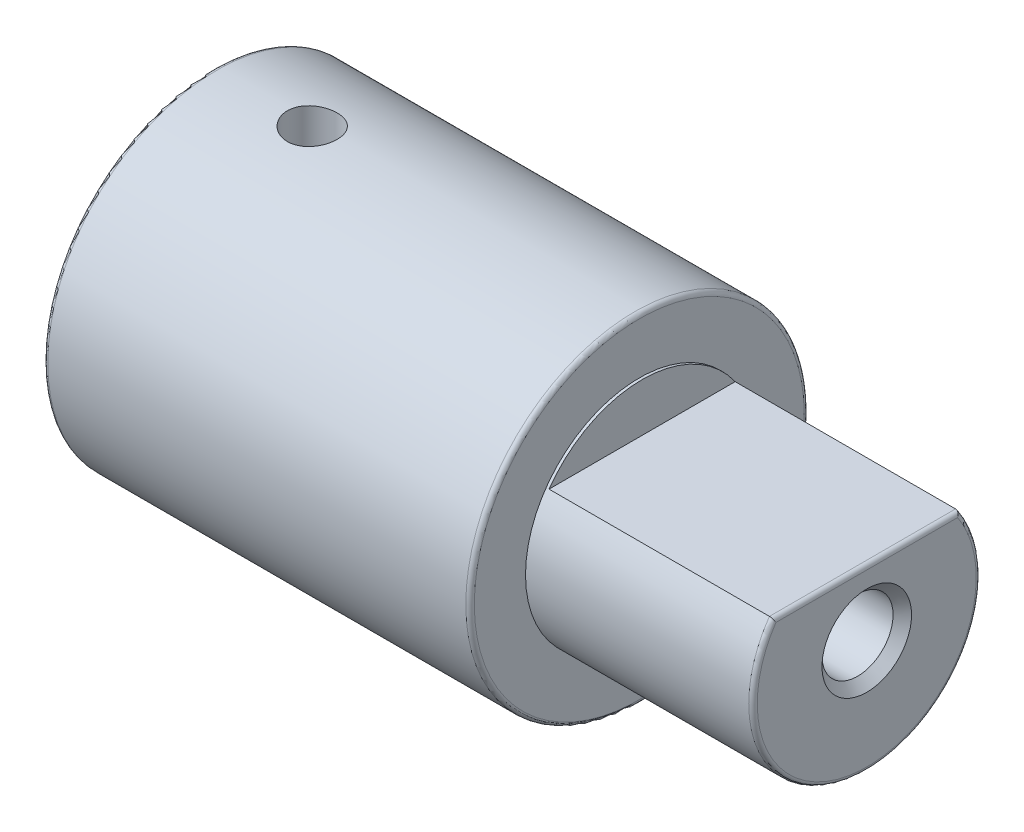
ISO-10303-21;
HEADER;
FILE_DESCRIPTION(('STEP AP214'),'2;1');
FILE_NAME('part.step','',(''),(''),'','','');
FILE_SCHEMA(('AUTOMOTIVE_DESIGN { 1 0 10303 214 1 1 1 1 }'));
ENDSEC;
DATA;
#1=APPLICATION_CONTEXT('core data for automotive mechanical design processes');
#2=APPLICATION_PROTOCOL_DEFINITION('international standard','automotive_design',2000,#1);
#3=PRODUCT_CONTEXT('',#1,'mechanical');
#4=PRODUCT('Part','Part','',(#3));
#5=PRODUCT_RELATED_PRODUCT_CATEGORY('part','',(#4));
#6=PRODUCT_DEFINITION_FORMATION('','',#4);
#7=PRODUCT_DEFINITION_CONTEXT('part definition',#1,'design');
#8=PRODUCT_DEFINITION('design','',#6,#7);
#9=PRODUCT_DEFINITION_SHAPE('','',#8);
#10=(LENGTH_UNIT() NAMED_UNIT(*) SI_UNIT(.MILLI.,.METRE.));
#11=(NAMED_UNIT(*) PLANE_ANGLE_UNIT() SI_UNIT($,.RADIAN.));
#12=(NAMED_UNIT(*) SI_UNIT($,.STERADIAN.) SOLID_ANGLE_UNIT());
#13=UNCERTAINTY_MEASURE_WITH_UNIT(LENGTH_MEASURE(1.E-05),#10,'distance_accuracy_value','');
#14=(GEOMETRIC_REPRESENTATION_CONTEXT(3) GLOBAL_UNCERTAINTY_ASSIGNED_CONTEXT((#13)) GLOBAL_UNIT_ASSIGNED_CONTEXT((#10,
#11,#12)) REPRESENTATION_CONTEXT('',''));
#15=CARTESIAN_POINT('',(0.,0.,0.));
#16=DIRECTION('',(0.,0.,1.));
#17=DIRECTION('',(1.,0.,0.));
#18=AXIS2_PLACEMENT_3D('',#15,#16,#17);
#19=CARTESIAN_POINT('',(22.9999999999677,0.,0.));
#20=DIRECTION('',(1.,0.,0.));
#21=DIRECTION('',(0.,0.,-1.));
#22=AXIS2_PLACEMENT_3D('',#19,#20,#21);
#23=CONICAL_SURFACE('',#22,1.5749999999457,0.785398163397448);
#24=CARTESIAN_POINT('',(22.675,0.,0.));
#25=DIRECTION('',(1.,0.,0.));
#26=DIRECTION('',(0.,0.,-1.));
#27=AXIS2_PLACEMENT_3D('',#24,#25,#26);
#28=CIRCLE('',#27,1.25);
#29=CARTESIAN_POINT('',(22.675,0.,-1.25));
#30=VERTEX_POINT('',#29);
#31=EDGE_CURVE('E311',#30,#30,#28,.F.);
#32=ORIENTED_EDGE('',*,*,#31,.T.);
#33=EDGE_LOOP('',(#32));
#34=FACE_BOUND('',#33,.T.);
#35=CARTESIAN_POINT('',(23.0000000000246,0.,0.));
#36=DIRECTION('',(1.,0.,0.));
#37=DIRECTION('',(0.,0.,-1.));
#38=AXIS2_PLACEMENT_3D('',#35,#36,#37);
#39=CIRCLE('',#38,1.57500000000255);
#40=CARTESIAN_POINT('',(23.0000000000246,0.,-1.57500000000255));
#41=VERTEX_POINT('',#40);
#42=EDGE_CURVE('E105',#41,#41,#39,.T.);
#43=ORIENTED_EDGE('',*,*,#42,.T.);
#44=EDGE_LOOP('',(#43));
#45=FACE_BOUND('',#44,.T.);
#46=ADVANCED_FACE('F17',(#34,#45),#23,.F.);
#47=CARTESIAN_POINT('',(23.,0.,0.));
#48=DIRECTION('',(-1.,0.,0.));
#49=DIRECTION('',(0.,0.,1.));
#50=AXIS2_PLACEMENT_3D('',#47,#48,#49);
#51=PLANE('',#50);
#52=ORIENTED_EDGE('',*,*,#42,.F.);
#53=EDGE_LOOP('',(#52));
#54=FACE_BOUND('',#53,.T.);
#55=CARTESIAN_POINT('',(23.,0.,0.));
#56=DIRECTION('',(-1.,0.,0.));
#57=DIRECTION('',(0.,0.,-1.));
#58=AXIS2_PLACEMENT_3D('',#55,#56,#57);
#59=CIRCLE('',#58,3.85);
#60=CARTESIAN_POINT('',(23.,0.,-3.85));
#61=VERTEX_POINT('',#60);
#62=CARTESIAN_POINT('',(23.,0.,3.85));
#63=VERTEX_POINT('',#62);
#64=EDGE_CURVE('E303',#61,#63,#59,.T.);
#65=ORIENTED_EDGE('',*,*,#64,.F.);
#66=CARTESIAN_POINT('',(23.,0.,0.));
#67=DIRECTION('',(-1.,0.,0.));
#68=DIRECTION('',(0.,0.558441558441559,-0.829543866112795));
#69=AXIS2_PLACEMENT_3D('',#66,#67,#68);
#70=CIRCLE('',#69,3.85);
#71=CARTESIAN_POINT('',(23.,2.15,-3.19374388453426));
#72=VERTEX_POINT('',#71);
#73=EDGE_CURVE('E301',#72,#61,#70,.T.);
#74=ORIENTED_EDGE('',*,*,#73,.F.);
#75=DIRECTION('',(0.,0.,-1.));
#76=VECTOR('',#75,1.);
#77=CARTESIAN_POINT('',(23.,2.15,3.27261363439071));
#78=LINE('',#77,#76);
#79=CARTESIAN_POINT('',(23.,2.15,3.19374388453426));
#80=VERTEX_POINT('',#79);
#81=EDGE_CURVE('E108',#80,#72,#78,.T.);
#82=ORIENTED_EDGE('',*,*,#81,.F.);
#83=CARTESIAN_POINT('',(23.,0.,0.));
#84=DIRECTION('',(-1.,0.,0.));
#85=DIRECTION('',(0.,0.,1.));
#86=AXIS2_PLACEMENT_3D('',#83,#84,#85);
#87=CIRCLE('',#86,3.85);
#88=EDGE_CURVE('E310',#63,#80,#87,.T.);
#89=ORIENTED_EDGE('',*,*,#88,.F.);
#90=EDGE_LOOP('',(#65,#74,#82,#89));
#91=FACE_BOUND('',#90,.T.);
#92=ADVANCED_FACE('F388',(#54,#91),#51,.F.);
#93=CARTESIAN_POINT('',(22.85,2.15,3.27261363439071));
#94=DIRECTION('',(0.,0.,-1.));
#95=DIRECTION('',(-1.,0.,0.));
#96=AXIS2_PLACEMENT_3D('',#93,#94,#95);
#97=CYLINDRICAL_SURFACE('',#96,0.150000000000001);
#98=CARTESIAN_POINT('',(22.85,2.3,-3.27261363439071));
#99=CARTESIAN_POINT('',(22.8524318392568,2.30000008341764,-3.27261370406818));
#100=CARTESIAN_POINT('',(22.8548636229384,2.29993940416577,-3.27258394411226));
#101=CARTESIAN_POINT('',(22.8597373837745,2.29969730815042,-3.27246409428101));
#102=CARTESIAN_POINT('',(22.8621793069761,2.29951501906196,-3.27237356849433));
#103=CARTESIAN_POINT('',(22.8670673497827,2.29902862361025,-3.27213055168672));
#104=CARTESIAN_POINT('',(22.8695133508707,2.29872356880205,-3.27197757808033));
#105=CARTESIAN_POINT('',(22.8744034044036,2.29799087466964,-3.27160834583458));
#106=CARTESIAN_POINT('',(22.8768472646861,2.29756221845494,-3.27139156189498));
#107=CARTESIAN_POINT('',(22.8817266989836,2.29658171891855,-3.27089358607451));
#108=CARTESIAN_POINT('',(22.8841619985871,2.29602879748348,-3.2706118299068));
#109=CARTESIAN_POINT('',(22.8890178101046,2.29479938177936,-3.26998303249975));
#110=CARTESIAN_POINT('',(22.8914379579059,2.2941217563713,-3.26963539271823));
#111=CARTESIAN_POINT('',(22.8962568111002,2.29264276144623,-3.26887420008181));
#112=CARTESIAN_POINT('',(22.8986550562955,2.29184021633358,-3.26846001969404));
#113=CARTESIAN_POINT('',(22.9034233133949,2.29011143713649,-3.26756538236598));
#114=CARTESIAN_POINT('',(22.9057927638038,2.28918399192984,-3.26708427471715));
#115=CARTESIAN_POINT('',(22.910496521221,2.28720570140233,-3.26605569593551));
#116=CARTESIAN_POINT('',(22.9128301614079,2.28615361854491,-3.26550755715792));
#117=CARTESIAN_POINT('',(22.917455288076,2.28392658383511,-3.26434511736968));
#118=CARTESIAN_POINT('',(22.9197459995774,2.28275037721407,-3.26373013834348));
#119=CARTESIAN_POINT('',(22.924278177337,2.28027587332416,-3.26243452203661));
#120=CARTESIAN_POINT('',(22.926518758788,2.27897631315334,-3.26175320320422));
#121=CARTESIAN_POINT('',(22.9309435290557,2.27625614212082,-3.26032571445014));
#122=CARTESIAN_POINT('',(22.9331267227564,2.27483426925003,-3.25957886629403));
#123=CARTESIAN_POINT('',(22.9374295219132,2.27187074976456,-3.25802148085305));
#124=CARTESIAN_POINT('',(22.9395480223709,2.27032785043302,-3.2572102760604));
#125=CARTESIAN_POINT('',(22.9437142726963,2.26712391153327,-3.2555255482532));
#126=CARTESIAN_POINT('',(22.9457608098479,2.2654616380164,-3.25465137392367));
#127=CARTESIAN_POINT('',(22.9497758115742,2.26202050795037,-3.25284288817276));
#128=CARTESIAN_POINT('',(22.9517429560917,2.26024043979166,-3.2519079544583));
#129=CARTESIAN_POINT('',(22.9555925475579,2.25656686442007,-3.24997869756369));
#130=CARTESIAN_POINT('',(22.9574735789795,2.2546721922726,-3.24898376499522));
#131=CARTESIAN_POINT('',(22.9605185079082,2.25143131899379,-3.24728930038924));
#132=CARTESIAN_POINT('',(22.9617147027681,2.2501097990234,-3.24660029821422));
#133=CARTESIAN_POINT('',(22.9641104469911,2.24736198722726,-3.24517328025639));
#134=CARTESIAN_POINT('',(22.9653073011024,2.24593373186008,-3.24443451508476));
#135=CARTESIAN_POINT('',(22.9676965486744,2.24297135273272,-3.24290393173913));
#136=CARTESIAN_POINT('',(22.9688861185356,2.24143540099172,-3.24211124785351));
#137=CARTESIAN_POINT('',(22.9712520453868,2.23825575084292,-3.24047017768529));
#138=CARTESIAN_POINT('',(22.9724254282287,2.23661030678104,-3.23962088620659));
#139=CARTESIAN_POINT('',(22.9747497102096,2.23321036130809,-3.23786393305812));
#140=CARTESIAN_POINT('',(22.9758974838765,2.23145420999781,-3.23695533051844));
#141=CARTESIAN_POINT('',(22.9781606377592,2.2278317759453,-3.23507756169377));
#142=CARTESIAN_POINT('',(22.9792727354324,2.2259639366557,-3.23410744244195));
#143=CARTESIAN_POINT('',(22.9814540323177,2.22211744424295,-3.23210487217084));
#144=CARTESIAN_POINT('',(22.9825197886987,2.22013733199258,-3.23107147412737));
#145=CARTESIAN_POINT('',(22.984597309765,2.21606602126589,-3.22894111507403));
#146=CARTESIAN_POINT('',(22.9856054688067,2.21397346519612,-3.22784323257434));
#147=CARTESIAN_POINT('',(22.98755614291,2.20967746388108,-3.22558328018562));
#148=CARTESIAN_POINT('',(22.9884948883947,2.20747276823051,-3.22442033364772));
#149=CARTESIAN_POINT('',(22.9902945599571,2.20295320331037,-3.22203032108496));
#150=CARTESIAN_POINT('',(22.9911515528118,2.20063719737359,-3.22080244284331));
#151=CARTESIAN_POINT('',(22.9927750686716,2.19589629866092,-3.21828341119169));
#152=CARTESIAN_POINT('',(22.9935374966855,2.19347039036655,-3.21699152974505));
#153=CARTESIAN_POINT('',(22.9949588183363,2.18851159606667,-3.21434619920791));
#154=CARTESIAN_POINT('',(22.9956134588383,2.18597782376108,-3.21299212620341));
#155=CARTESIAN_POINT('',(22.9968057982978,2.18080588454395,-3.21022506942431));
#156=CARTESIAN_POINT('',(22.9973390913937,2.17816696918434,-3.20881158592145));
#157=CARTESIAN_POINT('',(22.9982750831535,2.17278804518336,-3.2059294034421));
#158=CARTESIAN_POINT('',(22.9986732309305,2.17004743482351,-3.20446034916053));
#159=CARTESIAN_POINT('',(22.9993251011609,2.1644692024921,-3.20147183266287));
#160=CARTESIAN_POINT('',(22.9995741364432,2.16163113515198,-3.19995217947917));
#161=CARTESIAN_POINT('',(22.9999140287388,2.15586282764278,-3.19686850777236));
#162=CARTESIAN_POINT('',(23.0000000773715,2.15293230622882,-3.19530448367478));
#163=CARTESIAN_POINT('',(23.,2.15,-3.19374388453426));
#164=B_SPLINE_CURVE_WITH_KNOTS('',3,(#98,#99,#100,#101,#102,#103,#104,#105,#106,#107,#108,#109,
#110,#111,#112,#113,#114,#115,#116,#117,#118,#119,#120,#121,#122,#123,#124,#125,#126,#127,#128,
#129,#130,#131,#132,#133,#134,#135,#136,#137,#138,#139,#140,#141,#142,#143,#144,#145,#146,#147,
#148,#149,#150,#151,#152,#153,#154,#155,#156,#157,#158,#159,#160,#161,#162,#163),.UNSPECIFIED.,
.F.,.F.,(4,2,2,2,2,2,2,2,2,2,2,2,2,2,2,2,2,2,2,2,2,2,2,2,2,2,2,2,2,2,2,2,4),(0.,
0.00729449896146499,0.0146418932326524,0.0220471753308281,0.0295152107285662,0.0370507269164062,
0.0446583037255812,0.052342364951742,0.0601071712981854,0.0679568146368445,0.0758952135675672,
0.0839261102412973,0.0920530684004847,0.100279472580574,0.108608528409544,0.117043263937778,
0.125586531927917,0.131318490786174,0.137330688657677,0.143623918786729,0.150198806928837,
0.157055833332637,0.164195350609605,0.1716175984867,0.179322716208401,0.187310753186001,
0.195581678366424,0.20413538869814,0.21297171699916,0.222090439475816,0.231491283096034,
0.241173932984506,0.251138039976403),.UNSPECIFIED.);
#165=CARTESIAN_POINT('',(22.85,2.3,-3.27261363439071));
#166=VERTEX_POINT('',#165);
#167=EDGE_CURVE('E306',#166,#72,#164,.T.);
#168=ORIENTED_EDGE('',*,*,#167,.F.);
#169=DIRECTION('',(0.,0.,-1.));
#170=VECTOR('',#169,1.);
#171=CARTESIAN_POINT('',(22.85,2.3,3.27261363439071));
#172=LINE('',#171,#170);
#173=CARTESIAN_POINT('',(22.85,2.3,3.27261363439071));
#174=VERTEX_POINT('',#173);
#175=EDGE_CURVE('E83',#166,#174,#172,.F.);
#176=ORIENTED_EDGE('',*,*,#175,.T.);
#177=CARTESIAN_POINT('',(23.,2.15,3.19374388453426));
#178=CARTESIAN_POINT('',(23.0000000773124,2.15293165855233,3.19530413885872));
#179=CARTESIAN_POINT('',(22.9999140667182,2.15586153163478,3.19686781936378));
#180=CARTESIAN_POINT('',(22.9995743206863,2.16162862429996,3.19995085258619));
#181=CARTESIAN_POINT('',(22.9993253880504,2.16446612483805,3.20147021068521));
#182=CARTESIAN_POINT('',(22.9986737763716,2.17004330824347,3.20445818866821));
#183=CARTESIAN_POINT('',(22.9982757791738,2.17278343597049,3.20592699909241));
#184=CARTESIAN_POINT('',(22.997340125418,2.1781614811399,3.20880874670521));
#185=CARTESIAN_POINT('',(22.9968070146935,2.18079999959116,3.21022203858428));
#186=CARTESIAN_POINT('',(22.9956150612121,2.18597123212395,3.21298876469323));
#187=CARTESIAN_POINT('',(22.9949606195448,2.18850469376419,3.21434269789293));
#188=CARTESIAN_POINT('',(22.9935397021049,2.19346295364473,3.21698779983522));
#189=CARTESIAN_POINT('',(22.9927774749816,2.19588863713469,3.21827959163335));
#190=CARTESIAN_POINT('',(22.9911543537778,2.20062917212778,3.22079849234871));
#191=CARTESIAN_POINT('',(22.9902975504897,2.202945037955,3.22202632838701));
#192=CARTESIAN_POINT('',(22.9884982383673,2.207464406846,3.22441630134403));
#193=CARTESIAN_POINT('',(22.9875596588402,2.20966904525333,3.22557924954916));
#194=CARTESIAN_POINT('',(22.9856092855323,2.21396501401347,3.22783924578932));
#195=CARTESIAN_POINT('',(22.9846012576884,2.21605759333063,3.22893716956983));
#196=CARTESIAN_POINT('',(22.9825239576339,2.22012902978891,3.2310676468543));
#197=CARTESIAN_POINT('',(22.9814582876915,2.22210924297362,3.23210112101347));
#198=CARTESIAN_POINT('',(22.9792771131858,2.22595601344918,3.23410387395823));
#199=CARTESIAN_POINT('',(22.9781650483294,2.22782402821379,3.23507409904286));
#200=CARTESIAN_POINT('',(22.9759019016268,2.23144688620489,3.23695210441717));
#201=CARTESIAN_POINT('',(22.9747540994332,2.23320328421882,3.23786083710332));
#202=CARTESIAN_POINT('',(22.972429695002,2.23660379253978,3.23961807000141));
#203=CARTESIAN_POINT('',(22.9712562155667,2.23824955088351,3.24046751069933));
#204=CARTESIAN_POINT('',(22.9688900245238,2.24142989620722,3.24210889242787));
#205=CARTESIAN_POINT('',(22.9677002845818,2.24296622682796,3.24290173854427));
#206=CARTESIAN_POINT('',(22.965310620213,2.24592942493971,3.24443265634273));
#207=CARTESIAN_POINT('',(22.9641135171191,2.24735811835508,3.24517159379519));
#208=CARTESIAN_POINT('',(22.9617171970663,2.25010687122754,3.24659895259999));
#209=CARTESIAN_POINT('',(22.9605206731112,2.25142889162771,3.24728812417515));
#210=CARTESIAN_POINT('',(22.9574756541117,2.25467016978686,3.24898256511013));
#211=CARTESIAN_POINT('',(22.9555948920171,2.25656477294774,3.24997731206973));
#212=CARTESIAN_POINT('',(22.9517458205151,2.2602382355034,3.25190625910445));
#213=CARTESIAN_POINT('',(22.9497789249187,2.26201825856957,3.25284106732024));
#214=CARTESIAN_POINT('',(22.9457643989081,2.265459331216,3.25464934727008));
#215=CARTESIAN_POINT('',(22.9437180868675,2.26712159090256,3.25552344018997));
#216=CARTESIAN_POINT('',(22.9395522568093,2.27032552933637,3.25720804911675));
#217=CARTESIAN_POINT('',(22.9374339499323,2.27186844046846,3.25801921525963));
#218=CARTESIAN_POINT('',(22.933131502172,2.27483200819736,3.25957656160129));
#219=CARTESIAN_POINT('',(22.930948464804,2.27625391584089,3.26032340811969));
#220=CARTESIAN_POINT('',(22.9265239660038,2.27897417733394,3.26175092673782));
#221=CARTESIAN_POINT('',(22.9242834983053,2.28027379142936,3.26243227586529));
#222=CARTESIAN_POINT('',(22.9197515022579,2.28274842033665,3.26372798024234));
#223=CARTESIAN_POINT('',(22.9174608574372,2.28392469619281,3.26434301582746));
#224=CARTESIAN_POINT('',(22.9128358144814,2.28615188252704,3.26550559036597));
#225=CARTESIAN_POINT('',(22.9105021901549,2.28720404582484,3.26605380611313));
#226=CARTESIAN_POINT('',(22.9057984117318,2.28918250622645,3.26708255439749));
#227=CARTESIAN_POINT('',(22.9034289233975,2.29011003882969,3.26756375335705));
#228=CARTESIAN_POINT('',(22.8986605354163,2.29183899752864,3.26845858266168));
#229=CARTESIAN_POINT('',(22.8962621963226,2.29264163262567,3.26887286249674));
#230=CARTESIAN_POINT('',(22.8914430987694,2.29412080786684,3.26963425708434));
#231=CARTESIAN_POINT('',(22.8890227996877,2.29479852140762,3.26998199815951));
#232=CARTESIAN_POINT('',(22.8841666282798,2.29602810932669,3.27061099487746));
#233=CARTESIAN_POINT('',(22.8817311193737,2.29658111257387,3.2708928478649));
#234=CARTESIAN_POINT('',(22.8768512091275,2.29756176728715,3.27139100773226));
#235=CARTESIAN_POINT('',(22.8744070816378,2.29799049453383,3.27160787771852));
#236=CARTESIAN_POINT('',(22.8695164370607,2.29872331793353,3.27197726621545));
#237=CARTESIAN_POINT('',(22.8670701117106,2.29902842859173,3.27213030886727));
#238=CARTESIAN_POINT('',(22.8621813651978,2.29951491864653,3.27237344178534));
#239=CARTESIAN_POINT('',(22.8597390622662,2.29969724406127,3.27246401350297));
#240=CARTESIAN_POINT('',(22.8548644888391,2.2999393915471,3.27258392724483));
#241=CARTESIAN_POINT('',(22.8524322721539,2.30000008348978,3.27261370407754));
#242=CARTESIAN_POINT('',(22.85,2.3,3.27261363439071));
#243=B_SPLINE_CURVE_WITH_KNOTS('',3,(#177,#178,#179,#180,#181,#182,#183,#184,#185,#186,#187,
#188,#189,#190,#191,#192,#193,#194,#195,#196,#197,#198,#199,#200,#201,#202,#203,#204,#205,#206,
#207,#208,#209,#210,#211,#212,#213,#214,#215,#216,#217,#218,#219,#220,#221,#222,#223,#224,#225,
#226,#227,#228,#229,#230,#231,#232,#233,#234,#235,#236,#237,#238,#239,#240,#241,#242),
.UNSPECIFIED.,.F.,.F.,(4,2,2,2,2,2,2,2,2,2,2,2,2,2,2,2,2,2,2,2,2,2,2,2,2,2,2,2,2,2,2,2,4),(0.,
0.00996190650752161,0.0196426238996793,0.0290418035544405,0.0381591310946126,0.0469943339311323,
0.0555471886478935,0.0638175283643709,0.071805250242752,0.0795103233426546,0.0869327970710744,
0.094072810531416,0.100930603147525,0.107506527032898,0.113801061700045,0.119814831872546,
0.125548629389546,0.134091033367665,0.142525036447302,0.15085349368519,0.159079435369146,
0.167206069291863,0.175236782063142,0.183175139390314,0.19102488525915,0.198789939952408,
0.206474396850046,0.214082517964771,0.221618728178807,0.229087608162841,0.236493885975933,
0.243842427365354,0.251138224807842),.UNSPECIFIED.);
#244=EDGE_CURVE('E84',#80,#174,#243,.T.);
#245=ORIENTED_EDGE('',*,*,#244,.F.);
#246=ORIENTED_EDGE('',*,*,#81,.T.);
#247=EDGE_LOOP('',(#168,#176,#245,#246));
#248=FACE_BOUND('',#247,.T.);
#249=ADVANCED_FACE('F381',(#248),#97,.T.);
#250=CARTESIAN_POINT('',(23.,0.,0.));
#251=DIRECTION('',(1.,0.,0.));
#252=DIRECTION('',(0.,0.,-1.));
#253=AXIS2_PLACEMENT_3D('',#250,#251,#252);
#254=CYLINDRICAL_SURFACE('',#253,1.25);
#255=CARTESIAN_POINT('',(13.1,0.,0.));
#256=DIRECTION('',(1.,0.,0.));
#257=DIRECTION('',(0.,0.,-1.));
#258=AXIS2_PLACEMENT_3D('',#255,#256,#257);
#259=CIRCLE('',#258,1.25);
#260=CARTESIAN_POINT('',(13.1,0.,-1.25));
#261=VERTEX_POINT('',#260);
#262=EDGE_CURVE('E102',#261,#261,#259,.F.);
#263=ORIENTED_EDGE('',*,*,#262,.T.);
#264=EDGE_LOOP('',(#263));
#265=FACE_BOUND('',#264,.T.);
#266=ORIENTED_EDGE('',*,*,#31,.F.);
#267=EDGE_LOOP('',(#266));
#268=FACE_BOUND('',#267,.T.);
#269=ADVANCED_FACE('F270',(#265,#268),#254,.F.);
#270=CARTESIAN_POINT('',(22.85,0.,0.));
#271=DIRECTION('',(-1.,0.,0.));
#272=DIRECTION('',(0.,0.,1.));
#273=AXIS2_PLACEMENT_3D('',#270,#271,#272);
#274=TOROIDAL_SURFACE('',#273,3.85,0.15);
#275=ORIENTED_EDGE('',*,*,#244,.T.);
#276=CARTESIAN_POINT('',(22.85,0.,0.));
#277=DIRECTION('',(-1.,0.,0.));
#278=DIRECTION('',(0.,0.,1.));
#279=AXIS2_PLACEMENT_3D('',#276,#277,#278);
#280=CIRCLE('',#279,4.);
#281=EDGE_CURVE('E97',#166,#174,#280,.T.);
#282=ORIENTED_EDGE('',*,*,#281,.F.);
#283=ORIENTED_EDGE('',*,*,#167,.T.);
#284=ORIENTED_EDGE('',*,*,#73,.T.);
#285=ORIENTED_EDGE('',*,*,#64,.T.);
#286=ORIENTED_EDGE('',*,*,#88,.T.);
#287=EDGE_LOOP('',(#275,#282,#283,#284,#285,#286));
#288=FACE_BOUND('',#287,.T.);
#289=ADVANCED_FACE('F265',(#288),#274,.T.);
#290=CARTESIAN_POINT('',(15.1,0.,0.));
#291=DIRECTION('',(-1.,0.,0.));
#292=DIRECTION('',(0.,0.,1.));
#293=AXIS2_PLACEMENT_3D('',#290,#291,#292);
#294=PLANE('',#293);
#295=DIRECTION('',(0.,0.,-1.));
#296=VECTOR('',#295,1.);
#297=CARTESIAN_POINT('',(15.1,2.3,3.27261363439071));
#298=LINE('',#297,#296);
#299=CARTESIAN_POINT('',(15.1,2.3,3.27261363439071));
#300=VERTEX_POINT('',#299);
#301=CARTESIAN_POINT('',(15.1,2.3,-3.27261363439071));
#302=VERTEX_POINT('',#301);
#303=EDGE_CURVE('E76',#300,#302,#298,.T.);
#304=ORIENTED_EDGE('',*,*,#303,.T.);
#305=CARTESIAN_POINT('',(15.1,0.,0.));
#306=DIRECTION('',(-1.,0.,0.));
#307=DIRECTION('',(0.,0.,1.));
#308=AXIS2_PLACEMENT_3D('',#305,#306,#307);
#309=CIRCLE('',#308,4.);
#310=EDGE_CURVE('E81',#300,#302,#309,.T.);
#311=ORIENTED_EDGE('',*,*,#310,.F.);
#312=EDGE_LOOP('',(#304,#311));
#313=FACE_BOUND('',#312,.T.);
#314=ADVANCED_FACE('F79',(#313),#294,.F.);
#315=CARTESIAN_POINT('',(15.1,2.3,3.27261363439071));
#316=DIRECTION('',(0.,-1.,0.));
#317=DIRECTION('',(0.,0.,-1.));
#318=AXIS2_PLACEMENT_3D('',#315,#316,#317);
#319=PLANE('',#318);
#320=ORIENTED_EDGE('',*,*,#175,.F.);
#321=DIRECTION('',(-1.,0.,0.));
#322=VECTOR('',#321,1.);
#323=CARTESIAN_POINT('',(0.,2.3,-3.27261363439071));
#324=LINE('',#323,#322);
#325=EDGE_CURVE('E88',#302,#166,#324,.F.);
#326=ORIENTED_EDGE('',*,*,#325,.F.);
#327=ORIENTED_EDGE('',*,*,#303,.F.);
#328=DIRECTION('',(-1.,0.,0.));
#329=VECTOR('',#328,1.);
#330=CARTESIAN_POINT('',(0.,2.3,3.27261363439071));
#331=LINE('',#330,#329);
#332=EDGE_CURVE('E95',#174,#300,#331,.T.);
#333=ORIENTED_EDGE('',*,*,#332,.F.);
#334=EDGE_LOOP('',(#320,#326,#327,#333));
#335=FACE_BOUND('',#334,.T.);
#336=ADVANCED_FACE('F89',(#335),#319,.F.);
#337=CARTESIAN_POINT('',(13.1,0.,-2.5));
#338=DIRECTION('',(1.,0.,0.));
#339=DIRECTION('',(0.,0.,-1.));
#340=AXIS2_PLACEMENT_3D('',#337,#338,#339);
#341=PLANE('',#340);
#342=CARTESIAN_POINT('',(13.1,0.,0.));
#343=DIRECTION('',(-1.,0.,0.));
#344=DIRECTION('',(0.,0.,1.));
#345=AXIS2_PLACEMENT_3D('',#342,#343,#344);
#346=CIRCLE('',#345,2.5);
#347=CARTESIAN_POINT('',(13.1,0.,2.5));
#348=VERTEX_POINT('',#347);
#349=EDGE_CURVE('E92',#348,#348,#346,.T.);
#350=ORIENTED_EDGE('',*,*,#349,.T.);
#351=EDGE_LOOP('',(#350));
#352=FACE_BOUND('',#351,.T.);
#353=ORIENTED_EDGE('',*,*,#262,.F.);
#354=EDGE_LOOP('',(#353));
#355=FACE_BOUND('',#354,.T.);
#356=ADVANCED_FACE('F353',(#352,#355),#341,.F.);
#357=CARTESIAN_POINT('',(0.,0.,0.));
#358=DIRECTION('',(-1.,0.,0.));
#359=DIRECTION('',(0.,0.,1.));
#360=AXIS2_PLACEMENT_3D('',#357,#358,#359);
#361=CYLINDRICAL_SURFACE('',#360,4.);
#362=CARTESIAN_POINT('',(15.,0.,0.));
#363=DIRECTION('',(-1.,0.,0.));
#364=DIRECTION('',(0.,0.,1.));
#365=AXIS2_PLACEMENT_3D('',#362,#363,#364);
#366=CIRCLE('',#365,4.);
#367=CARTESIAN_POINT('',(15.,0.,4.));
#368=VERTEX_POINT('',#367);
#369=EDGE_CURVE('E249',#368,#368,#366,.F.);
#370=ORIENTED_EDGE('',*,*,#369,.T.);
#371=EDGE_LOOP('',(#370));
#372=FACE_BOUND('',#371,.T.);
#373=ORIENTED_EDGE('',*,*,#310,.T.);
#374=ORIENTED_EDGE('',*,*,#325,.T.);
#375=ORIENTED_EDGE('',*,*,#281,.T.);
#376=ORIENTED_EDGE('',*,*,#332,.T.);
#377=EDGE_LOOP('',(#373,#374,#375,#376));
#378=FACE_BOUND('',#377,.T.);
#379=ADVANCED_FACE('F94',(#372,#378),#361,.T.);
#380=CARTESIAN_POINT('',(0.,0.,0.));
#381=DIRECTION('',(-1.,0.,0.));
#382=DIRECTION('',(0.,0.,1.));
#383=AXIS2_PLACEMENT_3D('',#380,#381,#382);
#384=CYLINDRICAL_SURFACE('',#383,2.5);
#385=ORIENTED_EDGE('',*,*,#349,.F.);
#386=EDGE_LOOP('',(#385));
#387=FACE_BOUND('',#386,.T.);
#388=CARTESIAN_POINT('',(3.5,2.3418742493994,0.875));
#389=CARTESIAN_POINT('',(3.54743562559354,2.34187674125323,0.874997206130524));
#390=CARTESIAN_POINT('',(3.59491901719264,2.34333389452915,0.871123738636784));
#391=CARTESIAN_POINT('',(3.68851771788669,2.34898284150086,0.855770478536314));
#392=CARTESIAN_POINT('',(3.73463062697874,2.35317916735769,0.844278079357541));
#393=CARTESIAN_POINT('',(3.82404150749596,2.3637705406446,0.81415053385621));
#394=CARTESIAN_POINT('',(3.86734686416647,2.37015951601794,0.795535097013381));
#395=CARTESIAN_POINT('',(3.95021963185555,2.38440828521483,0.751748013605474));
#396=CARTESIAN_POINT('',(3.9897872558678,2.3922679951528,0.726576740930387));
#397=CARTESIAN_POINT('',(4.06579354692764,2.40895566669966,0.669221425342289));
#398=CARTESIAN_POINT('',(4.10204766592213,2.41780956760305,0.636800279826349));
#399=CARTESIAN_POINT('',(4.16873295198251,2.435270215175,0.566369126964281));
#400=CARTESIAN_POINT('',(4.19916279129313,2.44387690510795,0.528357848725361));
#401=CARTESIAN_POINT('',(4.25418756360116,2.46017515357011,0.446462480063938));
#402=CARTESIAN_POINT('',(4.27858709454561,2.46783282370597,0.402439757134438));
#403=CARTESIAN_POINT('',(4.31955995866474,2.48106341741615,0.310600211972126));
#404=CARTESIAN_POINT('',(4.33613565637377,2.48663697075043,0.26278454116098));
#405=CARTESIAN_POINT('',(4.36035839418915,2.49488808627339,0.166647218091691));
#406=CARTESIAN_POINT('',(4.36832118707442,2.49766777658022,0.118414054559285));
#407=CARTESIAN_POINT('',(4.37609904382316,2.50038203735424,0.0212213954492219));
#408=CARTESIAN_POINT('',(4.37591641941223,2.50031741505705,-0.0277378901067488));
#409=CARTESIAN_POINT('',(4.3676026040376,2.49741791430431,-0.122747050656745));
#410=CARTESIAN_POINT('',(4.35981502361222,2.49470279374924,-0.168831260369123));
#411=CARTESIAN_POINT('',(4.33708429486182,2.48696031181122,-0.258991954351887));
#412=CARTESIAN_POINT('',(4.32214062458988,2.48193278176807,-0.303068291916356));
#413=CARTESIAN_POINT('',(4.28533723249241,2.46998452710176,-0.388679759215578));
#414=CARTESIAN_POINT('',(4.26338490431617,2.46303863094655,-0.430171420195225));
#415=CARTESIAN_POINT('',(4.21326671760331,2.4479694135917,-0.508977124042036));
#416=CARTESIAN_POINT('',(4.18509931594092,2.43984580015154,-0.546290125925241));
#417=CARTESIAN_POINT('',(4.12165239125844,2.4227767230715,-0.617714036001659));
#418=CARTESIAN_POINT('',(4.08608163345293,2.41381047887628,-0.651561628704854));
#419=CARTESIAN_POINT('',(4.00968666340055,2.39640866018696,-0.712913303224693));
#420=CARTESIAN_POINT('',(3.96885976943353,2.38797335987823,-0.740414126730655));
#421=CARTESIAN_POINT('',(3.88218571012116,2.37246547514956,-0.788710581573834));
#422=CARTESIAN_POINT('',(3.83626206561367,2.36541984486129,-0.809378030930262));
#423=CARTESIAN_POINT('',(3.74132374363783,2.35380734891559,-0.842558611383922));
#424=CARTESIAN_POINT('',(3.69231589294835,2.34923520973434,-0.855089102137414));
#425=CARTESIAN_POINT('',(3.61903161214688,2.34477850483855,-0.867195327645686));
#426=CARTESIAN_POINT('',(3.59533693229116,2.34369342469378,-0.870118097456614));
#427=CARTESIAN_POINT('',(3.54776554018833,2.34224066817207,-0.874021140784256));
#428=CARTESIAN_POINT('',(3.52388882725805,2.34187299448888,-0.87500140700717));
#429=CARTESIAN_POINT('',(3.45256437440646,2.34187674125322,-0.874997206130525));
#430=CARTESIAN_POINT('',(3.40508098280736,2.34333389452915,-0.871123738636784));
#431=CARTESIAN_POINT('',(3.31148228211331,2.34898284150086,-0.855770478536314));
#432=CARTESIAN_POINT('',(3.26536937302126,2.35317916735769,-0.844278079357542));
#433=CARTESIAN_POINT('',(3.17595849250405,2.3637705406446,-0.81415053385621));
#434=CARTESIAN_POINT('',(3.13265313583353,2.37015951601794,-0.795535097013382));
#435=CARTESIAN_POINT('',(3.04978036814445,2.38440828521483,-0.751748013605475));
#436=CARTESIAN_POINT('',(3.0102127441322,2.39226799515279,-0.726576740930388));
#437=CARTESIAN_POINT('',(2.93420645307236,2.40895566669966,-0.66922142534229));
#438=CARTESIAN_POINT('',(2.89795233407787,2.41780956760305,-0.63680027982635));
#439=CARTESIAN_POINT('',(2.83126704801749,2.435270215175,-0.566369126964282));
#440=CARTESIAN_POINT('',(2.80083720870687,2.44387690510795,-0.528357848725362));
#441=CARTESIAN_POINT('',(2.74581243639884,2.46017515357011,-0.446462480063939));
#442=CARTESIAN_POINT('',(2.72141290545439,2.46783282370597,-0.402439757134439));
#443=CARTESIAN_POINT('',(2.68044004133526,2.48106341741615,-0.310600211972127));
#444=CARTESIAN_POINT('',(2.66386434362623,2.48663697075043,-0.262784541160981));
#445=CARTESIAN_POINT('',(2.63964160581085,2.49488808627339,-0.166647218091692));
#446=CARTESIAN_POINT('',(2.63167881292558,2.49766777658022,-0.118414054559287));
#447=CARTESIAN_POINT('',(2.62390095617684,2.50038203735424,-0.0212213954492233));
#448=CARTESIAN_POINT('',(2.62408358058777,2.50031741505705,0.0277378901067476));
#449=CARTESIAN_POINT('',(2.6323973959624,2.49741791430431,0.122747050656744));
#450=CARTESIAN_POINT('',(2.64018497638778,2.49470279374924,0.168831260369122));
#451=CARTESIAN_POINT('',(2.66291570513818,2.48696031181122,0.258991954351886));
#452=CARTESIAN_POINT('',(2.67785937541012,2.48193278176807,0.303068291916355));
#453=CARTESIAN_POINT('',(2.71466276750759,2.46998452710176,0.388679759215577));
#454=CARTESIAN_POINT('',(2.73661509568383,2.46303863094655,0.430171420195224));
#455=CARTESIAN_POINT('',(2.78673328239669,2.4479694135917,0.508977124042035));
#456=CARTESIAN_POINT('',(2.81490068405908,2.43984580015154,0.54629012592524));
#457=CARTESIAN_POINT('',(2.87834760874156,2.4227767230715,0.617714036001658));
#458=CARTESIAN_POINT('',(2.91391836654706,2.41381047887628,0.651561628704853));
#459=CARTESIAN_POINT('',(2.99031333659944,2.39640866018696,0.712913303224692));
#460=CARTESIAN_POINT('',(3.03114023056647,2.38797335987823,0.740414126730654));
#461=CARTESIAN_POINT('',(3.11781428987883,2.37246547514956,0.788710581573834));
#462=CARTESIAN_POINT('',(3.16373793438633,2.36541984486129,0.809378030930262));
#463=CARTESIAN_POINT('',(3.25867625636217,2.35380734891559,0.842558611383922));
#464=CARTESIAN_POINT('',(3.30768410705165,2.34923520973434,0.855089102137414));
#465=CARTESIAN_POINT('',(3.38096838785312,2.34477850483855,0.867195327645686));
#466=CARTESIAN_POINT('',(3.40466306770884,2.34369342469378,0.870118097456614));
#467=CARTESIAN_POINT('',(3.45223445981167,2.34224066817207,0.874021140784256));
#468=CARTESIAN_POINT('',(3.47611117274195,2.34187299448888,0.87500140700717));
#469=CARTESIAN_POINT('',(3.5,2.3418742493994,0.875));
#470=B_SPLINE_CURVE_WITH_KNOTS('',3,(#388,#389,#390,#391,#392,#393,#394,#395,#396,#397,#398,
#399,#400,#401,#402,#403,#404,#405,#406,#407,#408,#409,#410,#411,#412,#413,#414,#415,#416,#417,
#418,#419,#420,#421,#422,#423,#424,#425,#426,#427,#428,#429,#430,#431,#432,#433,#434,#435,#436,
#437,#438,#439,#440,#441,#442,#443,#444,#445,#446,#447,#448,#449,#450,#451,#452,#453,#454,#455,
#456,#457,#458,#459,#460,#461,#462,#463,#464,#465,#466,#467,#468,#469),.UNSPECIFIED.,.T.,.F.,(4,
2,2,2,2,2,2,2,2,2,2,2,2,2,2,2,2,2,2,2,2,2,2,2,2,2,2,2,2,2,2,2,2,2,2,2,2,2,2,2,4),(0.,
0.142213785233007,0.284663472038128,0.426721817299715,0.568772062516009,0.716415538396297,
0.864092632428544,1.01606398397434,1.16798937698315,1.31413369781762,1.46023654214993,
1.60002973138892,1.73983311833975,1.88156602229612,2.02333415645529,2.17239216200838,
2.32152652172134,2.47331772809521,2.62478402481014,2.69640335627872,2.76802295666632,
2.91023674189933,3.05268642870445,3.19474477396604,3.33679501918233,3.48443849506262,
3.63211558909487,3.78408694064066,3.93601233364947,4.08215665448394,4.22825949881626,
4.36805268805524,4.50785607500607,4.64958897896244,4.79135711312161,4.94041511867471,
5.08954947838766,5.24134068476153,5.39280698147646,5.46442631294505,5.53604591333265),.UNSPECIFIED.);
#471=CARTESIAN_POINT('',(3.5,2.3418742493994,0.875));
#472=VERTEX_POINT('',#471);
#473=EDGE_CURVE('E322',#472,#472,#470,.T.);
#474=ORIENTED_EDGE('',*,*,#473,.T.);
#475=EDGE_LOOP('',(#474));
#476=FACE_BOUND('',#475,.T.);
#477=CARTESIAN_POINT('',(0.150000000000003,0.,0.));
#478=DIRECTION('',(1.,0.,0.));
#479=DIRECTION('',(0.,0.,-1.));
#480=AXIS2_PLACEMENT_3D('',#477,#478,#479);
#481=CIRCLE('',#480,2.5);
#482=CARTESIAN_POINT('',(0.150000000000003,0.,-2.5));
#483=VERTEX_POINT('',#482);
#484=EDGE_CURVE('E247',#483,#483,#481,.T.);
#485=ORIENTED_EDGE('',*,*,#484,.F.);
#486=EDGE_LOOP('',(#485));
#487=FACE_BOUND('',#486,.T.);
#488=ADVANCED_FACE('F352',(#387,#476,#487),#384,.F.);
#489=CARTESIAN_POINT('',(0.150000000000003,0.,0.));
#490=DIRECTION('',(1.,0.,0.));
#491=DIRECTION('',(0.,0.,-1.));
#492=AXIS2_PLACEMENT_3D('',#489,#490,#491);
#493=TOROIDAL_SURFACE('',#492,2.65,0.15);
#494=CARTESIAN_POINT('',(0.,0.,0.));
#495=DIRECTION('',(-1.,0.,0.));
#496=DIRECTION('',(0.,0.,-1.));
#497=AXIS2_PLACEMENT_3D('',#494,#495,#496);
#498=CIRCLE('',#497,2.65);
#499=CARTESIAN_POINT('',(0.,0.,-2.65));
#500=VERTEX_POINT('',#499);
#501=CARTESIAN_POINT('',(0.,0.,2.65));
#502=VERTEX_POINT('',#501);
#503=EDGE_CURVE('E164',#500,#502,#498,.T.);
#504=ORIENTED_EDGE('',*,*,#503,.T.);
#505=CARTESIAN_POINT('',(0.,0.,0.));
#506=DIRECTION('',(-1.,0.,0.));
#507=DIRECTION('',(0.,0.,1.));
#508=AXIS2_PLACEMENT_3D('',#505,#506,#507);
#509=CIRCLE('',#508,2.65);
#510=EDGE_CURVE('E174',#502,#500,#509,.T.);
#511=ORIENTED_EDGE('',*,*,#510,.T.);
#512=EDGE_LOOP('',(#504,#511));
#513=FACE_BOUND('',#512,.T.);
#514=ORIENTED_EDGE('',*,*,#484,.T.);
#515=EDGE_LOOP('',(#514));
#516=FACE_BOUND('',#515,.T.);
#517=ADVANCED_FACE('F210',(#513,#516),#493,.T.);
#518=CARTESIAN_POINT('',(15.,0.,-4.));
#519=DIRECTION('',(-1.,0.,0.));
#520=DIRECTION('',(0.,0.,1.));
#521=AXIS2_PLACEMENT_3D('',#518,#519,#520);
#522=PLANE('',#521);
#523=ORIENTED_EDGE('',*,*,#369,.F.);
#524=EDGE_LOOP('',(#523));
#525=FACE_BOUND('',#524,.T.);
#526=CARTESIAN_POINT('',(15.,0.,0.));
#527=DIRECTION('',(-1.,0.,0.));
#528=DIRECTION('',(0.,0.,1.));
#529=AXIS2_PLACEMENT_3D('',#526,#527,#528);
#530=CIRCLE('',#529,5.80000000000001);
#531=CARTESIAN_POINT('',(15.,0.,5.80000000000001));
#532=VERTEX_POINT('',#531);
#533=CARTESIAN_POINT('',(15.,0.,-5.80000000000001));
#534=VERTEX_POINT('',#533);
#535=EDGE_CURVE('E112',#532,#534,#530,.T.);
#536=ORIENTED_EDGE('',*,*,#535,.F.);
#537=CARTESIAN_POINT('',(15.,0.,0.));
#538=DIRECTION('',(-1.,0.,0.));
#539=DIRECTION('',(0.,0.,-1.));
#540=AXIS2_PLACEMENT_3D('',#537,#538,#539);
#541=CIRCLE('',#540,5.80000000000001);
#542=EDGE_CURVE('E225',#534,#532,#541,.T.);
#543=ORIENTED_EDGE('',*,*,#542,.F.);
#544=EDGE_LOOP('',(#536,#543));
#545=FACE_BOUND('',#544,.T.);
#546=ADVANCED_FACE('F200',(#525,#545),#522,.F.);
#547=CARTESIAN_POINT('',(3.5,-0.0499999999999954,0.));
#548=DIRECTION('',(0.,1.,0.));
#549=DIRECTION('',(0.,0.,1.));
#550=AXIS2_PLACEMENT_3D('',#547,#548,#549);
#551=CYLINDRICAL_SURFACE('',#550,0.875);
#552=ORIENTED_EDGE('',*,*,#473,.F.);
#553=EDGE_LOOP('',(#552));
#554=FACE_BOUND('',#553,.T.);
#555=CARTESIAN_POINT('',(3.5,5.88531010228009,-0.875));
#556=CARTESIAN_POINT('',(3.54883188194621,5.88531138081402,-0.874996203107587));
#557=CARTESIAN_POINT('',(3.59770102463776,5.885924674582,-0.870897091180427));
#558=CARTESIAN_POINT('',(3.69412268113449,5.88831250124863,-0.854599634237833));
#559=CARTESIAN_POINT('',(3.74167227764132,5.89008942191236,-0.842384634647743));
#560=CARTESIAN_POINT('',(3.83397492165581,5.89459851183236,-0.810228540846875));
#561=CARTESIAN_POINT('',(3.87873116276915,5.89732956575461,-0.79029646458142));
#562=CARTESIAN_POINT('',(3.96424559627961,5.90343777449045,-0.743290893061217));
#563=CARTESIAN_POINT('',(4.00500535180912,5.90681467515895,-0.71622020531669));
#564=CARTESIAN_POINT('',(4.08170750938873,5.91386401676942,-0.655477746296715));
#565=CARTESIAN_POINT('',(4.11761427050735,5.91753835744062,-0.621761183726165));
#566=CARTESIAN_POINT('',(4.18328357933015,5.92475175964655,-0.548779197608545));
#567=CARTESIAN_POINT('',(4.21304548151938,5.92829080693698,-0.509513191823826));
#568=CARTESIAN_POINT('',(4.26570660448351,5.93485412580043,-0.426324570107184));
#569=CARTESIAN_POINT('',(4.28857368166904,5.93787595869927,-0.382381397447666));
#570=CARTESIAN_POINT('',(4.32658954645736,5.94304371337155,-0.291226609146325));
#571=CARTESIAN_POINT('',(4.341738793538,5.94518968728739,-0.24401518826845));
#572=CARTESIAN_POINT('',(4.36378298114672,5.94835076680641,-0.148025120032946));
#573=CARTESIAN_POINT('',(4.37073668383046,5.94937391935833,-0.0992602367285061));
#574=CARTESIAN_POINT('',(4.37637480543333,5.95020164265147,-0.0012457039319385));
#575=CARTESIAN_POINT('',(4.37505965293863,5.95000627655019,0.048003920303292));
#576=CARTESIAN_POINT('',(4.36424388057628,5.94842541702428,0.145188620962531));
#577=CARTESIAN_POINT('',(4.35480654901318,5.94704912566014,0.193130911719929));
#578=CARTESIAN_POINT('',(4.32811346605905,5.94327129800571,0.286744304229241));
#579=CARTESIAN_POINT('',(4.31085745347868,5.94086972746531,0.33241533005115));
#580=CARTESIAN_POINT('',(4.26895105232599,5.93529526481896,0.420382862039011));
#581=CARTESIAN_POINT('',(4.24427368383688,5.93211956653406,0.462666330302474));
#582=CARTESIAN_POINT('',(4.18824693079429,5.92535129840456,0.542512603346531));
#583=CARTESIAN_POINT('',(4.15689765100097,5.92175873510584,0.580075482233535));
#584=CARTESIAN_POINT('',(4.08807006696112,5.91451789933497,0.649784503681588));
#585=CARTESIAN_POINT('',(4.05053765291147,5.91086941913399,0.681877218783813));
#586=CARTESIAN_POINT('',(3.97057261501921,5.90395881415442,0.739331358720114));
#587=CARTESIAN_POINT('',(3.92813777933233,5.90069686512362,0.764689728039615));
#588=CARTESIAN_POINT('',(3.83950171429325,5.89492818782307,0.807960778899546));
#589=CARTESIAN_POINT('',(3.7932948038551,5.89242262643103,0.825861972267516));
#590=CARTESIAN_POINT('',(3.69856096454403,5.88846961853033,0.853595657451097));
#591=CARTESIAN_POINT('',(3.65003917494494,5.88701993459963,0.863445216269678));
#592=CARTESIAN_POINT('',(3.56752327812579,5.88560103985029,0.87304660249413));
#593=CARTESIAN_POINT('',(3.53377054933299,5.8853092180874,0.875002625807925));
#594=CARTESIAN_POINT('',(3.45116811805379,5.88531138081402,0.874996203107587));
#595=CARTESIAN_POINT('',(3.40229897536224,5.885924674582,0.870897091180427));
#596=CARTESIAN_POINT('',(3.30587731886551,5.88831250124863,0.854599634237833));
#597=CARTESIAN_POINT('',(3.25832772235868,5.89008942191236,0.842384634647743));
#598=CARTESIAN_POINT('',(3.16602507834419,5.89459851183236,0.810228540846875));
#599=CARTESIAN_POINT('',(3.12126883723085,5.89732956575461,0.790296464581421));
#600=CARTESIAN_POINT('',(3.03575440372039,5.90343777449045,0.743290893061218));
#601=CARTESIAN_POINT('',(2.99499464819088,5.90681467515895,0.716220205316691));
#602=CARTESIAN_POINT('',(2.91829249061127,5.91386401676942,0.655477746296716));
#603=CARTESIAN_POINT('',(2.88238572949265,5.91753835744062,0.621761183726165));
#604=CARTESIAN_POINT('',(2.81671642066985,5.92475175964655,0.548779197608546));
#605=CARTESIAN_POINT('',(2.78695451848062,5.92829080693698,0.509513191823827));
#606=CARTESIAN_POINT('',(2.73429339551649,5.93485412580043,0.426324570107185));
#607=CARTESIAN_POINT('',(2.71142631833096,5.93787595869927,0.382381397447667));
#608=CARTESIAN_POINT('',(2.67341045354264,5.94304371337155,0.291226609146326));
#609=CARTESIAN_POINT('',(2.658261206462,5.94518968728739,0.244015188268451));
#610=CARTESIAN_POINT('',(2.63621701885328,5.94835076680641,0.148025120032947));
#611=CARTESIAN_POINT('',(2.62926331616954,5.94937391935833,0.0992602367285074));
#612=CARTESIAN_POINT('',(2.62362519456667,5.95020164265147,0.00124570393193983));
#613=CARTESIAN_POINT('',(2.62494034706137,5.95000627655019,-0.0480039203032907));
#614=CARTESIAN_POINT('',(2.63575611942372,5.94842541702428,-0.14518862096253));
#615=CARTESIAN_POINT('',(2.64519345098682,5.94704912566014,-0.193130911719928));
#616=CARTESIAN_POINT('',(2.67188653394095,5.94327129800571,-0.28674430422924));
#617=CARTESIAN_POINT('',(2.68914254652132,5.94086972746531,-0.332415330051149));
#618=CARTESIAN_POINT('',(2.73104894767401,5.93529526481896,-0.420382862039009));
#619=CARTESIAN_POINT('',(2.75572631616312,5.93211956653406,-0.462666330302473));
#620=CARTESIAN_POINT('',(2.8117530692057,5.92535129840456,-0.54251260334653));
#621=CARTESIAN_POINT('',(2.84310234899903,5.92175873510584,-0.580075482233534));
#622=CARTESIAN_POINT('',(2.91192993303888,5.91451789933497,-0.649784503681587));
#623=CARTESIAN_POINT('',(2.94946234708853,5.91086941913399,-0.681877218783812));
#624=CARTESIAN_POINT('',(3.02942738498079,5.90395881415442,-0.739331358720113));
#625=CARTESIAN_POINT('',(3.07186222066767,5.90069686512362,-0.764689728039615));
#626=CARTESIAN_POINT('',(3.16049828570675,5.89492818782307,-0.807960778899545));
#627=CARTESIAN_POINT('',(3.2067051961449,5.89242262643103,-0.825861972267515));
#628=CARTESIAN_POINT('',(3.30143903545597,5.88846961853033,-0.853595657451097));
#629=CARTESIAN_POINT('',(3.34996082505506,5.88701993459963,-0.863445216269678));
#630=CARTESIAN_POINT('',(3.43247672187421,5.88560103985029,-0.87304660249413));
#631=CARTESIAN_POINT('',(3.46622945066701,5.8853092180874,-0.875002625807925));
#632=CARTESIAN_POINT('',(3.5,5.88531010228009,-0.875));
#633=B_SPLINE_CURVE_WITH_KNOTS('',3,(#555,#556,#557,#558,#559,#560,#561,#562,#563,#564,#565,
#566,#567,#568,#569,#570,#571,#572,#573,#574,#575,#576,#577,#578,#579,#580,#581,#582,#583,#584,
#585,#586,#587,#588,#589,#590,#591,#592,#593,#594,#595,#596,#597,#598,#599,#600,#601,#602,#603,
#604,#605,#606,#607,#608,#609,#610,#611,#612,#613,#614,#615,#616,#617,#618,#619,#620,#621,#622,
#623,#624,#625,#626,#627,#628,#629,#630,#631,#632),.UNSPECIFIED.,.T.,.F.,(4,2,2,2,2,2,2,2,2,2,2,
2,2,2,2,2,2,2,2,2,2,2,2,2,2,2,2,2,2,2,2,2,2,2,2,2,2,2,4),(0.,0.146386370378786,
0.293074071178649,0.43959087198095,0.586050135611142,0.733532499844925,0.881030349167347,
1.02920556200368,1.17737195225817,1.32446939674768,1.47155921703658,1.61751317919059,
1.76347201741407,1.90996803037494,2.05646174327337,2.20431312760192,2.35223148104852,
2.50037687524184,2.64820742623328,2.74944350286041,2.89582987323919,3.04251757403905,
3.18903437484136,3.33549363847155,3.48297600270533,3.63047385202775,3.77864906486408,
3.92681545511858,4.07391289960808,4.22100271989699,4.36695668205099,4.51291552027447,
4.65941153323534,4.80590524613378,4.95375663046232,5.10167498390892,5.24982037810225,
5.39765092909369,5.49888700572081),.UNSPECIFIED.);
#634=CARTESIAN_POINT('',(3.5,5.88531010228009,-0.875));
#635=VERTEX_POINT('',#634);
#636=EDGE_CURVE('E317',#635,#635,#633,.T.);
#637=ORIENTED_EDGE('',*,*,#636,.F.);
#638=EDGE_LOOP('',(#637));
#639=FACE_BOUND('',#638,.T.);
#640=ADVANCED_FACE('F209',(#554,#639),#551,.F.);
#641=CARTESIAN_POINT('',(0.,0.,-5.95));
#642=DIRECTION('',(1.,0.,0.));
#643=DIRECTION('',(0.,0.,-1.));
#644=AXIS2_PLACEMENT_3D('',#641,#642,#643);
#645=PLANE('',#644);
#646=ORIENTED_EDGE('',*,*,#503,.F.);
#647=ORIENTED_EDGE('',*,*,#510,.F.);
#648=EDGE_LOOP('',(#646,#647));
#649=FACE_BOUND('',#648,.T.);
#650=CARTESIAN_POINT('',(0.,0.,0.));
#651=DIRECTION('',(1.,0.,0.));
#652=DIRECTION('',(0.,0.,-1.));
#653=AXIS2_PLACEMENT_3D('',#650,#651,#652);
#654=CIRCLE('',#653,5.80000000000001);
#655=CARTESIAN_POINT('',(0.,0.,-5.80000000000001));
#656=VERTEX_POINT('',#655);
#657=CARTESIAN_POINT('',(0.,0.,5.80000000000001));
#658=VERTEX_POINT('',#657);
#659=EDGE_CURVE('E36',#656,#658,#654,.T.);
#660=ORIENTED_EDGE('',*,*,#659,.F.);
#661=CARTESIAN_POINT('',(0.,0.,0.));
#662=DIRECTION('',(1.,0.,0.));
#663=DIRECTION('',(0.,0.,1.));
#664=AXIS2_PLACEMENT_3D('',#661,#662,#663);
#665=CIRCLE('',#664,5.80000000000001);
#666=EDGE_CURVE('E151',#658,#656,#665,.T.);
#667=ORIENTED_EDGE('',*,*,#666,.F.);
#668=EDGE_LOOP('',(#660,#667));
#669=FACE_BOUND('',#668,.T.);
#670=ADVANCED_FACE('F131',(#649,#669),#645,.F.);
#671=CARTESIAN_POINT('',(14.85,0.,0.));
#672=DIRECTION('',(-1.,0.,0.));
#673=DIRECTION('',(0.,0.,1.));
#674=AXIS2_PLACEMENT_3D('',#671,#672,#673);
#675=TOROIDAL_SURFACE('',#674,5.80000000000001,0.15);
#676=ORIENTED_EDGE('',*,*,#535,.T.);
#677=ORIENTED_EDGE('',*,*,#542,.T.);
#678=EDGE_LOOP('',(#676,#677));
#679=FACE_BOUND('',#678,.T.);
#680=CARTESIAN_POINT('',(14.85,0.,0.));
#681=DIRECTION('',(-1.,0.,0.));
#682=DIRECTION('',(0.,0.,1.));
#683=AXIS2_PLACEMENT_3D('',#680,#681,#682);
#684=CIRCLE('',#683,5.95);
#685=CARTESIAN_POINT('',(14.85,0.,5.95));
#686=VERTEX_POINT('',#685);
#687=EDGE_CURVE('E28',#686,#686,#684,.T.);
#688=ORIENTED_EDGE('',*,*,#687,.F.);
#689=EDGE_LOOP('',(#688));
#690=FACE_BOUND('',#689,.T.);
#691=ADVANCED_FACE('F119',(#679,#690),#675,.T.);
#692=CARTESIAN_POINT('',(0.150000000000003,0.,0.));
#693=DIRECTION('',(1.,0.,0.));
#694=DIRECTION('',(0.,0.,-1.));
#695=AXIS2_PLACEMENT_3D('',#692,#693,#694);
#696=TOROIDAL_SURFACE('',#695,5.80000000000001,0.15);
#697=CARTESIAN_POINT('',(0.150000000000003,0.,0.));
#698=DIRECTION('',(-1.,0.,0.));
#699=DIRECTION('',(0.,0.,1.));
#700=AXIS2_PLACEMENT_3D('',#697,#698,#699);
#701=CIRCLE('',#700,5.95);
#702=CARTESIAN_POINT('',(0.150000000000003,0.,5.95));
#703=VERTEX_POINT('',#702);
#704=EDGE_CURVE('E11',#703,#703,#701,.F.);
#705=ORIENTED_EDGE('',*,*,#704,.F.);
#706=EDGE_LOOP('',(#705));
#707=FACE_BOUND('',#706,.T.);
#708=ORIENTED_EDGE('',*,*,#666,.T.);
#709=ORIENTED_EDGE('',*,*,#659,.T.);
#710=EDGE_LOOP('',(#708,#709));
#711=FACE_BOUND('',#710,.T.);
#712=ADVANCED_FACE('F130',(#707,#711),#696,.T.);
#713=CARTESIAN_POINT('',(0.,0.,0.));
#714=DIRECTION('',(-1.,0.,0.));
#715=DIRECTION('',(0.,0.,1.));
#716=AXIS2_PLACEMENT_3D('',#713,#714,#715);
#717=CYLINDRICAL_SURFACE('',#716,5.95);
#718=ORIENTED_EDGE('',*,*,#687,.T.);
#719=EDGE_LOOP('',(#718));
#720=FACE_BOUND('',#719,.T.);
#721=ORIENTED_EDGE('',*,*,#704,.T.);
#722=EDGE_LOOP('',(#721));
#723=FACE_BOUND('',#722,.T.);
#724=ORIENTED_EDGE('',*,*,#636,.T.);
#725=EDGE_LOOP('',(#724));
#726=FACE_BOUND('',#725,.T.);
#727=ADVANCED_FACE('F325',(#720,#723,#726),#717,.T.);
#728=CLOSED_SHELL('',(#46,#92,#249,#269,#289,#314,#336,#356,#379,#488,#517,#546,#640,#670,#691,
#712,#727));
#729=MANIFOLD_SOLID_BREP('B1',#728);
#730=ADVANCED_BREP_SHAPE_REPRESENTATION('',(#18,#729),#14);
#731=SHAPE_DEFINITION_REPRESENTATION(#9,#730);
ENDSEC;
END-ISO-10303-21;
